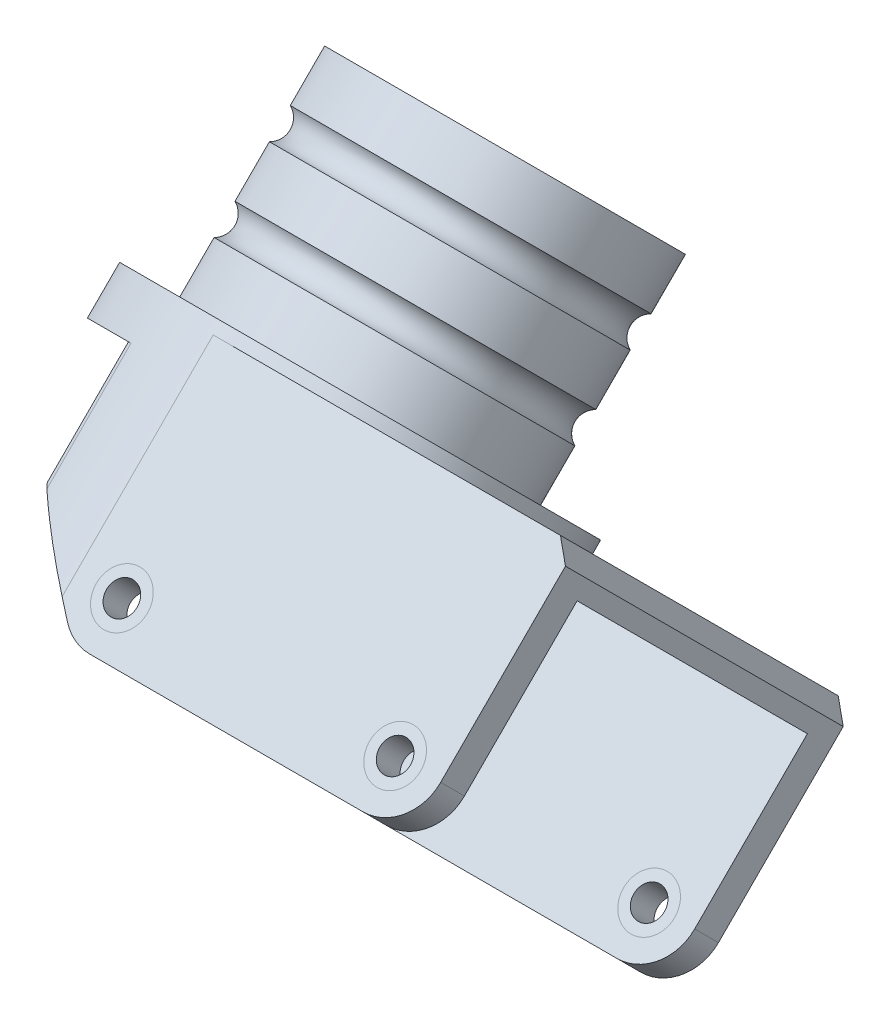
ISO-10303-21;
HEADER;
FILE_DESCRIPTION(('STEP AP214'),'2;1');
FILE_NAME('part.step','',(''),(''),'','','');
FILE_SCHEMA(('AUTOMOTIVE_DESIGN { 1 0 10303 214 1 1 1 1 }'));
ENDSEC;
DATA;
#1=APPLICATION_CONTEXT('core data for automotive mechanical design processes');
#2=APPLICATION_PROTOCOL_DEFINITION('international standard','automotive_design',2000,#1);
#3=PRODUCT_CONTEXT('',#1,'mechanical');
#4=PRODUCT('Part','Part','',(#3));
#5=PRODUCT_RELATED_PRODUCT_CATEGORY('part','',(#4));
#6=PRODUCT_DEFINITION_FORMATION('','',#4);
#7=PRODUCT_DEFINITION_CONTEXT('part definition',#1,'design');
#8=PRODUCT_DEFINITION('design','',#6,#7);
#9=PRODUCT_DEFINITION_SHAPE('','',#8);
#10=(LENGTH_UNIT() NAMED_UNIT(*) SI_UNIT(.MILLI.,.METRE.));
#11=(NAMED_UNIT(*) PLANE_ANGLE_UNIT() SI_UNIT($,.RADIAN.));
#12=(NAMED_UNIT(*) SI_UNIT($,.STERADIAN.) SOLID_ANGLE_UNIT());
#13=UNCERTAINTY_MEASURE_WITH_UNIT(LENGTH_MEASURE(1.E-05),#10,'distance_accuracy_value','');
#14=(GEOMETRIC_REPRESENTATION_CONTEXT(3) GLOBAL_UNCERTAINTY_ASSIGNED_CONTEXT((#13)) GLOBAL_UNIT_ASSIGNED_CONTEXT((#10,
#11,#12)) REPRESENTATION_CONTEXT('',''));
#15=CARTESIAN_POINT('',(0.,0.,0.));
#16=DIRECTION('',(0.,0.,1.));
#17=DIRECTION('',(1.,0.,0.));
#18=AXIS2_PLACEMENT_3D('',#15,#16,#17);
#19=CARTESIAN_POINT('',(4.,41.7193000900052,287.438906552332));
#20=DIRECTION('',(0.,-0.707106781186548,-0.707106781186547));
#21=DIRECTION('',(0.,0.707106781186547,-0.707106781186548));
#22=AXIS2_PLACEMENT_3D('',#19,#20,#21);
#23=PLANE('',#22);
#24=CARTESIAN_POINT('',(4.,41.7193000900051,287.438906552332));
#25=DIRECTION('',(0.,-0.707106781186548,-0.707106781186547));
#26=DIRECTION('',(0.,0.707106781186547,-0.707106781186548));
#27=AXIS2_PLACEMENT_3D('',#24,#25,#26);
#28=CIRCLE('',#27,2.25000000000002);
#29=CARTESIAN_POINT('',(4.,43.3102903476749,285.847916294662));
#30=VERTEX_POINT('',#29);
#31=EDGE_CURVE('E296',#30,#30,#28,.F.);
#32=ORIENTED_EDGE('',*,*,#31,.T.);
#33=EDGE_LOOP('',(#32));
#34=FACE_BOUND('',#33,.T.);
#35=DIRECTION('',(1.,0.,0.));
#36=VECTOR('',#35,1.);
#37=CARTESIAN_POINT('',(32.,53.7401153701766,275.418091272161));
#38=LINE('',#37,#36);
#39=CARTESIAN_POINT('',(0.,53.7401153701765,275.418091272161));
#40=VERTEX_POINT('',#39);
#41=CARTESIAN_POINT('',(30.5,53.7401153701766,275.418091272161));
#42=VERTEX_POINT('',#41);
#43=EDGE_CURVE('E164',#40,#42,#38,.T.);
#44=ORIENTED_EDGE('',*,*,#43,.T.);
#45=DIRECTION('',(-0.707106781186549,0.499999999999999,-0.499999999999999));
#46=VECTOR('',#45,1.);
#47=CARTESIAN_POINT('',(25.75,57.0988725808127,272.059334061525));
#48=LINE('',#47,#46);
#49=CARTESIAN_POINT('',(32.,52.6794551983968,276.47875144394));
#50=VERTEX_POINT('',#49);
#51=EDGE_CURVE('E67',#42,#50,#48,.F.);
#52=ORIENTED_EDGE('',*,*,#51,.T.);
#53=DIRECTION('',(0.,-0.707106781186547,0.707106781186548));
#54=VECTOR('',#53,1.);
#55=CARTESIAN_POINT('',(32.,53.7401153701766,275.418091272161));
#56=LINE('',#55,#54);
#57=CARTESIAN_POINT('',(32.,41.7193000900052,287.438906552332));
#58=VERTEX_POINT('',#57);
#59=EDGE_CURVE('E183',#50,#58,#56,.T.);
#60=ORIENTED_EDGE('',*,*,#59,.T.);
#61=CARTESIAN_POINT('',(28.,41.7193000900052,287.438906552332));
#62=DIRECTION('',(0.,-0.707106781186548,-0.707106781186547));
#63=DIRECTION('',(0.,0.707106781186547,-0.707106781186548));
#64=AXIS2_PLACEMENT_3D('',#61,#62,#63);
#65=CIRCLE('',#64,3.99999999999999);
#66=CARTESIAN_POINT('',(28.,38.890872965259,290.267333677078));
#67=VERTEX_POINT('',#66);
#68=EDGE_CURVE('E390',#58,#67,#65,.T.);
#69=ORIENTED_EDGE('',*,*,#68,.T.);
#70=DIRECTION('',(-1.,0.,0.));
#71=VECTOR('',#70,1.);
#72=CARTESIAN_POINT('',(28.,38.8908729652591,290.267333677078));
#73=LINE('',#72,#71);
#74=CARTESIAN_POINT('',(4.,38.8908729652591,290.267333677078));
#75=VERTEX_POINT('',#74);
#76=EDGE_CURVE('E393',#67,#75,#73,.T.);
#77=ORIENTED_EDGE('',*,*,#76,.T.);
#78=CARTESIAN_POINT('',(4.,41.7193000900052,287.438906552332));
#79=DIRECTION('',(0.,-0.707106781186548,-0.707106781186547));
#80=DIRECTION('',(0.,0.707106781186547,-0.707106781186548));
#81=AXIS2_PLACEMENT_3D('',#78,#79,#80);
#82=CIRCLE('',#81,4.);
#83=CARTESIAN_POINT('',(1.30168005886331,39.6313501989321,289.526856443405));
#84=VERTEX_POINT('',#83);
#85=EDGE_CURVE('E396',#75,#84,#82,.T.);
#86=ORIENTED_EDGE('',*,*,#85,.T.);
#87=DIRECTION('',(-0.738201763377739,0.477000082047162,-0.477000082047161));
#88=VECTOR('',#87,1.);
#89=CARTESIAN_POINT('',(1.30168005886329,39.6313501989321,289.526856443405));
#90=LINE('',#89,#88);
#91=CARTESIAN_POINT('',(0.,40.4724501876885,288.685756454649));
#92=VERTEX_POINT('',#91);
#93=EDGE_CURVE('E167',#84,#92,#90,.T.);
#94=ORIENTED_EDGE('',*,*,#93,.T.);
#95=DIRECTION('',(0.,0.707106781186548,-0.707106781186548));
#96=VECTOR('',#95,1.);
#97=CARTESIAN_POINT('',(0.,26.693280989791,302.464925652546));
#98=LINE('',#97,#96);
#99=EDGE_CURVE('E161',#92,#40,#98,.T.);
#100=ORIENTED_EDGE('',*,*,#99,.T.);
#101=EDGE_LOOP('',(#44,#52,#60,#69,#77,#86,#94,#100));
#102=FACE_BOUND('',#101,.T.);
#103=CARTESIAN_POINT('',(28.,41.7193000900051,287.438906552332));
#104=DIRECTION('',(0.,-0.707106781186548,-0.707106781186547));
#105=DIRECTION('',(0.,0.707106781186547,-0.707106781186548));
#106=AXIS2_PLACEMENT_3D('',#103,#104,#105);
#107=CIRCLE('',#106,2.25000000000001);
#108=CARTESIAN_POINT('',(28.,43.3102903476749,285.847916294662));
#109=VERTEX_POINT('',#108);
#110=EDGE_CURVE('E12',#109,#109,#107,.F.);
#111=ORIENTED_EDGE('',*,*,#110,.T.);
#112=EDGE_LOOP('',(#111));
#113=FACE_BOUND('',#112,.T.);
#114=ADVANCED_FACE('F40',(#34,#102,#113),#23,.T.);
#115=CARTESIAN_POINT('',(0.,186.888322267604,186.888322267604));
#116=DIRECTION('',(0.,0.707106781186547,0.707106781186548));
#117=DIRECTION('',(0.,-0.707106781186548,0.707106781186547));
#118=AXIS2_PLACEMENT_3D('',#115,#116,#117);
#119=PLANE('',#118);
#120=CARTESIAN_POINT('',(4.,64.0285190364406,309.748125498768));
#121=DIRECTION('',(0.,0.707106781186547,0.707106781186548));
#122=DIRECTION('',(0.,-0.707106781186548,0.707106781186547));
#123=AXIS2_PLACEMENT_3D('',#120,#121,#122);
#124=CIRCLE('',#123,2.25000000000002);
#125=CARTESIAN_POINT('',(4.,62.4375287787709,311.339115756437));
#126=VERTEX_POINT('',#125);
#127=EDGE_CURVE('E300',#126,#126,#124,.F.);
#128=ORIENTED_EDGE('',*,*,#127,.F.);
#129=EDGE_LOOP('',(#128));
#130=FACE_BOUND('',#129,.T.);
#131=DIRECTION('',(-0.738201763377739,0.477000082047162,-0.477000082047161));
#132=VECTOR('',#131,1.);
#133=CARTESIAN_POINT('',(1.30168005886329,61.9405691453677,311.836075389841));
#134=LINE('',#133,#132);
#135=CARTESIAN_POINT('',(1.30168005886331,61.9405691453677,311.836075389841));
#136=VERTEX_POINT('',#135);
#137=CARTESIAN_POINT('',(-5.47471460443719,66.3192376486618,307.457406886546));
#138=VERTEX_POINT('',#137);
#139=EDGE_CURVE('E184',#136,#138,#134,.T.);
#140=ORIENTED_EDGE('',*,*,#139,.T.);
#141=DIRECTION('',(0.,-0.707106781186548,0.707106781186547));
#142=VECTOR('',#141,1.);
#143=CARTESIAN_POINT('',(-5.47471460443718,73.9280139730525,299.848630562156));
#144=LINE('',#143,#142);
#145=CARTESIAN_POINT('',(-5.47471460443718,73.9280139730525,299.848630562156));
#146=VERTEX_POINT('',#145);
#147=EDGE_CURVE('E277',#138,#146,#144,.F.);
#148=ORIENTED_EDGE('',*,*,#147,.T.);
#149=DIRECTION('',(1.,0.,0.));
#150=VECTOR('',#149,1.);
#151=CARTESIAN_POINT('',(-17.2499999999995,73.9280139730525,299.848630562156));
#152=LINE('',#151,#150);
#153=CARTESIAN_POINT('',(32.,73.9280139730525,299.848630562156));
#154=VERTEX_POINT('',#153);
#155=EDGE_CURVE('E224',#146,#154,#152,.T.);
#156=ORIENTED_EDGE('',*,*,#155,.T.);
#157=DIRECTION('',(0.,-0.707106781186548,0.707106781186547));
#158=VECTOR('',#157,1.);
#159=CARTESIAN_POINT('',(32.,76.0493343166122,297.727310218596));
#160=LINE('',#159,#158);
#161=CARTESIAN_POINT('',(32.,64.0285190364408,309.748125498767));
#162=VERTEX_POINT('',#161);
#163=EDGE_CURVE('E221',#154,#162,#160,.T.);
#164=ORIENTED_EDGE('',*,*,#163,.T.);
#165=CARTESIAN_POINT('',(28.,64.0285190364408,309.748125498767));
#166=DIRECTION('',(0.,0.707106781186547,0.707106781186548));
#167=DIRECTION('',(0.,-0.707106781186548,0.707106781186547));
#168=AXIS2_PLACEMENT_3D('',#165,#166,#167);
#169=CIRCLE('',#168,3.99999999999999);
#170=CARTESIAN_POINT('',(28.,61.2000919116946,312.576552623514));
#171=VERTEX_POINT('',#170);
#172=EDGE_CURVE('E240',#162,#171,#169,.F.);
#173=ORIENTED_EDGE('',*,*,#172,.T.);
#174=DIRECTION('',(-1.,0.,0.));
#175=VECTOR('',#174,1.);
#176=CARTESIAN_POINT('',(28.,61.2000919116946,312.576552623514));
#177=LINE('',#176,#175);
#178=CARTESIAN_POINT('',(4.,61.2000919116946,312.576552623514));
#179=VERTEX_POINT('',#178);
#180=EDGE_CURVE('E260',#171,#179,#177,.T.);
#181=ORIENTED_EDGE('',*,*,#180,.T.);
#182=CARTESIAN_POINT('',(4.,64.0285190364408,309.748125498767));
#183=DIRECTION('',(0.,0.707106781186547,0.707106781186548));
#184=DIRECTION('',(0.,-0.707106781186548,0.707106781186547));
#185=AXIS2_PLACEMENT_3D('',#182,#183,#184);
#186=CIRCLE('',#185,4.);
#187=EDGE_CURVE('E258',#179,#136,#186,.F.);
#188=ORIENTED_EDGE('',*,*,#187,.T.);
#189=EDGE_LOOP('',(#140,#148,#156,#164,#173,#181,#188));
#190=FACE_BOUND('',#189,.T.);
#191=CARTESIAN_POINT('',(28.,64.0285190364406,309.748125498768));
#192=DIRECTION('',(0.,0.707106781186547,0.707106781186548));
#193=DIRECTION('',(0.,-0.707106781186548,0.707106781186547));
#194=AXIS2_PLACEMENT_3D('',#191,#192,#193);
#195=CIRCLE('',#194,2.25000000000001);
#196=CARTESIAN_POINT('',(28.,62.4375287787709,311.339115756437));
#197=VERTEX_POINT('',#196);
#198=EDGE_CURVE('E51',#197,#197,#195,.F.);
#199=ORIENTED_EDGE('',*,*,#198,.F.);
#200=EDGE_LOOP('',(#199));
#201=FACE_BOUND('',#200,.T.);
#202=ADVANCED_FACE('F344',(#130,#190,#201),#119,.F.);
#203=CARTESIAN_POINT('',(0.,166.665068325669,166.665068325669));
#204=DIRECTION('',(0.,0.707106781186547,0.707106781186548));
#205=DIRECTION('',(0.,-0.707106781186548,0.707106781186547));
#206=AXIS2_PLACEMENT_3D('',#203,#204,#205);
#207=PLANE('',#206);
#208=CARTESIAN_POINT('',(4.,43.8052650945054,289.524871556832));
#209=DIRECTION('',(0.,0.707106781186547,0.707106781186548));
#210=DIRECTION('',(0.,-0.707106781186548,0.707106781186547));
#211=AXIS2_PLACEMENT_3D('',#208,#209,#210);
#212=CIRCLE('',#211,2.25000000000002);
#213=CARTESIAN_POINT('',(4.,42.2142748368356,291.115861814502));
#214=VERTEX_POINT('',#213);
#215=EDGE_CURVE('E304',#214,#214,#212,.F.);
#216=ORIENTED_EDGE('',*,*,#215,.T.);
#217=EDGE_LOOP('',(#216));
#218=FACE_BOUND('',#217,.T.);
#219=DIRECTION('',(1.,0.,0.));
#220=VECTOR('',#219,1.);
#221=CARTESIAN_POINT('',(-17.2499999999995,53.7047600311172,279.625376620221));
#222=LINE('',#221,#220);
#223=CARTESIAN_POINT('',(-5.47471460442752,53.7047600311172,279.625376620221));
#224=VERTEX_POINT('',#223);
#225=CARTESIAN_POINT('',(32.,53.7047600311172,279.625376620221));
#226=VERTEX_POINT('',#225);
#227=EDGE_CURVE('E222',#224,#226,#222,.T.);
#228=ORIENTED_EDGE('',*,*,#227,.F.);
#229=DIRECTION('',(0.,0.707106781186548,-0.707106781186547));
#230=VECTOR('',#229,1.);
#231=CARTESIAN_POINT('',(-5.47471460442752,166.665068325669,166.665068325669));
#232=LINE('',#231,#230);
#233=CARTESIAN_POINT('',(-5.47471460442751,46.0959837067203,287.234152944617));
#234=VERTEX_POINT('',#233);
#235=EDGE_CURVE('E271',#224,#234,#232,.F.);
#236=ORIENTED_EDGE('',*,*,#235,.T.);
#237=DIRECTION('',(-0.738201763377739,0.477000082047162,-0.477000082047161));
#238=VECTOR('',#237,1.);
#239=CARTESIAN_POINT('',(1.30168005886328,41.7173152034324,291.612821447905));
#240=LINE('',#239,#238);
#241=CARTESIAN_POINT('',(1.30168005886331,41.7173152034324,291.612821447905));
#242=VERTEX_POINT('',#241);
#243=EDGE_CURVE('E237',#242,#234,#240,.T.);
#244=ORIENTED_EDGE('',*,*,#243,.F.);
#245=CARTESIAN_POINT('',(4.,43.8052650945055,289.524871556832));
#246=DIRECTION('',(0.,0.707106781186547,0.707106781186548));
#247=DIRECTION('',(0.,-0.707106781186548,0.707106781186547));
#248=AXIS2_PLACEMENT_3D('',#245,#246,#247);
#249=CIRCLE('',#248,4.);
#250=CARTESIAN_POINT('',(4.,40.9768379697593,292.353298681578));
#251=VERTEX_POINT('',#250);
#252=EDGE_CURVE('E234',#251,#242,#249,.F.);
#253=ORIENTED_EDGE('',*,*,#252,.F.);
#254=DIRECTION('',(-1.,0.,0.));
#255=VECTOR('',#254,1.);
#256=CARTESIAN_POINT('',(28.,40.9768379697593,292.353298681578));
#257=LINE('',#256,#255);
#258=CARTESIAN_POINT('',(28.,40.9768379697593,292.353298681578));
#259=VERTEX_POINT('',#258);
#260=EDGE_CURVE('E231',#259,#251,#257,.T.);
#261=ORIENTED_EDGE('',*,*,#260,.F.);
#262=CARTESIAN_POINT('',(28.,43.8052650945055,289.524871556832));
#263=DIRECTION('',(0.,0.707106781186547,0.707106781186548));
#264=DIRECTION('',(0.,-0.707106781186548,0.707106781186547));
#265=AXIS2_PLACEMENT_3D('',#262,#263,#264);
#266=CIRCLE('',#265,3.99999999999999);
#267=CARTESIAN_POINT('',(32.,43.8052650945055,289.524871556832));
#268=VERTEX_POINT('',#267);
#269=EDGE_CURVE('E228',#268,#259,#266,.F.);
#270=ORIENTED_EDGE('',*,*,#269,.F.);
#271=DIRECTION('',(0.,-0.707106781186548,0.707106781186547));
#272=VECTOR('',#271,1.);
#273=CARTESIAN_POINT('',(32.,55.8260803746769,277.504056276661));
#274=LINE('',#273,#272);
#275=EDGE_CURVE('E217',#226,#268,#274,.T.);
#276=ORIENTED_EDGE('',*,*,#275,.F.);
#277=EDGE_LOOP('',(#228,#236,#244,#253,#261,#270,#276));
#278=FACE_BOUND('',#277,.T.);
#279=CARTESIAN_POINT('',(28.,43.8052650945054,289.524871556832));
#280=DIRECTION('',(0.,0.707106781186547,0.707106781186548));
#281=DIRECTION('',(0.,-0.707106781186548,0.707106781186547));
#282=AXIS2_PLACEMENT_3D('',#279,#280,#281);
#283=CIRCLE('',#282,2.25000000000001);
#284=CARTESIAN_POINT('',(28.,42.2142748368356,291.115861814502));
#285=VERTEX_POINT('',#284);
#286=EDGE_CURVE('E313',#285,#285,#283,.F.);
#287=ORIENTED_EDGE('',*,*,#286,.T.);
#288=EDGE_LOOP('',(#287));
#289=FACE_BOUND('',#288,.T.);
#290=ADVANCED_FACE('F332',(#218,#278,#289),#207,.T.);
#291=CARTESIAN_POINT('',(4.,66.1144840409411,311.834090503268));
#292=DIRECTION('',(0.,-0.707106781186548,-0.707106781186547));
#293=DIRECTION('',(0.,0.707106781186547,-0.707106781186548));
#294=AXIS2_PLACEMENT_3D('',#291,#292,#293);
#295=PLANE('',#294);
#296=CARTESIAN_POINT('',(4.,66.114484040941,311.834090503268));
#297=DIRECTION('',(0.,-0.707106781186548,-0.707106781186547));
#298=DIRECTION('',(0.,0.707106781186547,-0.707106781186548));
#299=AXIS2_PLACEMENT_3D('',#296,#297,#298);
#300=CIRCLE('',#299,2.25000000000002);
#301=CARTESIAN_POINT('',(4.,67.7054742986107,310.243100245598));
#302=VERTEX_POINT('',#301);
#303=EDGE_CURVE('E295',#302,#302,#300,.F.);
#304=ORIENTED_EDGE('',*,*,#303,.F.);
#305=EDGE_LOOP('',(#304));
#306=FACE_BOUND('',#305,.T.);
#307=DIRECTION('',(0.,-0.707106781186547,0.707106781186548));
#308=VECTOR('',#307,1.);
#309=CARTESIAN_POINT('',(32.,78.1352993211125,299.813275223096));
#310=LINE('',#309,#308);
#311=CARTESIAN_POINT('',(32.,77.0746391493327,300.873935394876));
#312=VERTEX_POINT('',#311);
#313=CARTESIAN_POINT('',(32.,66.1144840409411,311.834090503268));
#314=VERTEX_POINT('',#313);
#315=EDGE_CURVE('E401',#312,#314,#310,.T.);
#316=ORIENTED_EDGE('',*,*,#315,.F.);
#317=DIRECTION('',(0.707106781186549,-0.499999999999999,0.499999999999999));
#318=VECTOR('',#317,1.);
#319=CARTESIAN_POINT('',(30.5,78.1352993211125,299.813275223096));
#320=LINE('',#319,#318);
#321=CARTESIAN_POINT('',(30.5,78.1352993211125,299.813275223096));
#322=VERTEX_POINT('',#321);
#323=EDGE_CURVE('E293',#312,#322,#320,.F.);
#324=ORIENTED_EDGE('',*,*,#323,.T.);
#325=DIRECTION('',(1.,0.,0.));
#326=VECTOR('',#325,1.);
#327=CARTESIAN_POINT('',(32.,78.1352993211125,299.813275223096));
#328=LINE('',#327,#326);
#329=CARTESIAN_POINT('',(0.,78.1352993211124,299.813275223097));
#330=VERTEX_POINT('',#329);
#331=EDGE_CURVE('E399',#330,#322,#328,.T.);
#332=ORIENTED_EDGE('',*,*,#331,.F.);
#333=DIRECTION('',(0.,0.707106781186548,-0.707106781186548));
#334=VECTOR('',#333,1.);
#335=CARTESIAN_POINT('',(0.,51.088464940727,326.860109603482));
#336=LINE('',#335,#334);
#337=CARTESIAN_POINT('',(0.,64.8676341386244,313.080940405585));
#338=VERTEX_POINT('',#337);
#339=EDGE_CURVE('E188',#338,#330,#336,.T.);
#340=ORIENTED_EDGE('',*,*,#339,.F.);
#341=DIRECTION('',(-0.738201763377739,0.477000082047162,-0.477000082047161));
#342=VECTOR('',#341,1.);
#343=CARTESIAN_POINT('',(1.30168005886329,64.026534149868,313.922040394341));
#344=LINE('',#343,#342);
#345=CARTESIAN_POINT('',(1.30168005886331,64.026534149868,313.922040394341));
#346=VERTEX_POINT('',#345);
#347=EDGE_CURVE('E412',#346,#338,#344,.T.);
#348=ORIENTED_EDGE('',*,*,#347,.F.);
#349=CARTESIAN_POINT('',(4.,66.1144840409411,311.834090503268));
#350=DIRECTION('',(0.,-0.707106781186548,-0.707106781186547));
#351=DIRECTION('',(0.,0.707106781186547,-0.707106781186548));
#352=AXIS2_PLACEMENT_3D('',#349,#350,#351);
#353=CIRCLE('',#352,4.);
#354=CARTESIAN_POINT('',(4.,63.2860569161949,314.662517628014));
#355=VERTEX_POINT('',#354);
#356=EDGE_CURVE('E409',#355,#346,#353,.T.);
#357=ORIENTED_EDGE('',*,*,#356,.F.);
#358=DIRECTION('',(-1.,0.,0.));
#359=VECTOR('',#358,1.);
#360=CARTESIAN_POINT('',(28.,63.2860569161949,314.662517628014));
#361=LINE('',#360,#359);
#362=CARTESIAN_POINT('',(28.,63.2860569161949,314.662517628014));
#363=VERTEX_POINT('',#362);
#364=EDGE_CURVE('E406',#363,#355,#361,.T.);
#365=ORIENTED_EDGE('',*,*,#364,.F.);
#366=CARTESIAN_POINT('',(28.,66.1144840409411,311.834090503268));
#367=DIRECTION('',(0.,-0.707106781186548,-0.707106781186547));
#368=DIRECTION('',(0.,0.707106781186547,-0.707106781186548));
#369=AXIS2_PLACEMENT_3D('',#366,#367,#368);
#370=CIRCLE('',#369,3.99999999999999);
#371=EDGE_CURVE('E403',#314,#363,#370,.T.);
#372=ORIENTED_EDGE('',*,*,#371,.F.);
#373=EDGE_LOOP('',(#316,#324,#332,#340,#348,#357,#365,#372));
#374=FACE_BOUND('',#373,.T.);
#375=CARTESIAN_POINT('',(28.,66.114484040941,311.834090503268));
#376=DIRECTION('',(0.,-0.707106781186548,-0.707106781186547));
#377=DIRECTION('',(0.,0.707106781186547,-0.707106781186548));
#378=AXIS2_PLACEMENT_3D('',#375,#376,#377);
#379=CIRCLE('',#378,2.25000000000001);
#380=CARTESIAN_POINT('',(28.,67.7054742986107,310.243100245598));
#381=VERTEX_POINT('',#380);
#382=EDGE_CURVE('E45',#381,#381,#379,.F.);
#383=ORIENTED_EDGE('',*,*,#382,.F.);
#384=EDGE_LOOP('',(#383));
#385=FACE_BOUND('',#384,.T.);
#386=ADVANCED_FACE('F329',(#306,#374,#385),#295,.F.);
#387=ORIENTED_EDGE('',*,*,#110,.F.);
#388=EDGE_LOOP('',(#387));
#389=FACE_BOUND('',#388,.T.);
#390=CARTESIAN_POINT('',(28.,41.7193000900052,287.438906552332));
#391=DIRECTION('',(0.,-0.707106781186548,-0.707106781186547));
#392=DIRECTION('',(0.,0.707106781186547,-0.707106781186548));
#393=AXIS2_PLACEMENT_3D('',#390,#391,#392);
#394=CIRCLE('',#393,1.34999999999999);
#395=CARTESIAN_POINT('',(28.,42.673894244607,286.48431239773));
#396=VERTEX_POINT('',#395);
#397=EDGE_CURVE('E225',#396,#396,#394,.T.);
#398=ORIENTED_EDGE('',*,*,#397,.F.);
#399=EDGE_LOOP('',(#398));
#400=FACE_BOUND('',#399,.T.);
#401=ADVANCED_FACE('F331',(#389,#400),#23,.T.);
#402=ORIENTED_EDGE('',*,*,#198,.T.);
#403=EDGE_LOOP('',(#402));
#404=FACE_BOUND('',#403,.T.);
#405=CARTESIAN_POINT('',(28.,64.0285190364407,309.748125498768));
#406=DIRECTION('',(0.,0.707106781186547,0.707106781186548));
#407=DIRECTION('',(0.,-0.707106781186548,0.707106781186547));
#408=AXIS2_PLACEMENT_3D('',#405,#406,#407);
#409=CIRCLE('',#408,1.34999999999999);
#410=CARTESIAN_POINT('',(28.,63.0739248818389,310.702719653369));
#411=VERTEX_POINT('',#410);
#412=EDGE_CURVE('E249',#411,#411,#409,.T.);
#413=ORIENTED_EDGE('',*,*,#412,.T.);
#414=EDGE_LOOP('',(#413));
#415=FACE_BOUND('',#414,.T.);
#416=ADVANCED_FACE('F340',(#404,#415),#119,.F.);
#417=ORIENTED_EDGE('',*,*,#286,.F.);
#418=EDGE_LOOP('',(#417));
#419=FACE_BOUND('',#418,.T.);
#420=CARTESIAN_POINT('',(28.,43.8052650945054,289.524871556832));
#421=DIRECTION('',(0.,0.707106781186547,0.707106781186548));
#422=DIRECTION('',(0.,-0.707106781186548,0.707106781186547));
#423=AXIS2_PLACEMENT_3D('',#420,#421,#422);
#424=CIRCLE('',#423,1.34999999999999);
#425=CARTESIAN_POINT('',(28.,42.8506709399036,290.479465711434));
#426=VERTEX_POINT('',#425);
#427=EDGE_CURVE('E246',#426,#426,#424,.T.);
#428=ORIENTED_EDGE('',*,*,#427,.F.);
#429=EDGE_LOOP('',(#428));
#430=FACE_BOUND('',#429,.T.);
#431=ADVANCED_FACE('F347',(#419,#430),#207,.T.);
#432=ORIENTED_EDGE('',*,*,#382,.T.);
#433=EDGE_LOOP('',(#432));
#434=FACE_BOUND('',#433,.T.);
#435=CARTESIAN_POINT('',(28.,66.1144840409411,311.834090503268));
#436=DIRECTION('',(0.,0.707106781186548,0.707106781186548));
#437=DIRECTION('',(0.,-0.707106781186548,0.707106781186548));
#438=AXIS2_PLACEMENT_3D('',#435,#436,#437);
#439=CIRCLE('',#438,1.35);
#440=CARTESIAN_POINT('',(28.,65.1598898863393,312.78868465787));
#441=VERTEX_POINT('',#440);
#442=EDGE_CURVE('E250',#441,#441,#439,.T.);
#443=ORIENTED_EDGE('',*,*,#442,.F.);
#444=EDGE_LOOP('',(#443));
#445=FACE_BOUND('',#444,.T.);
#446=ADVANCED_FACE('F326',(#434,#445),#295,.F.);
#447=ORIENTED_EDGE('',*,*,#303,.T.);
#448=EDGE_LOOP('',(#447));
#449=FACE_BOUND('',#448,.T.);
#450=CARTESIAN_POINT('',(4.,66.1144840409411,311.834090503268));
#451=DIRECTION('',(0.,0.707106781186548,0.707106781186548));
#452=DIRECTION('',(0.,-0.707106781186548,0.707106781186548));
#453=AXIS2_PLACEMENT_3D('',#450,#451,#452);
#454=CIRCLE('',#453,1.35);
#455=CARTESIAN_POINT('',(4.,65.1598898863393,312.78868465787));
#456=VERTEX_POINT('',#455);
#457=EDGE_CURVE('E245',#456,#456,#454,.T.);
#458=ORIENTED_EDGE('',*,*,#457,.F.);
#459=EDGE_LOOP('',(#458));
#460=FACE_BOUND('',#459,.T.);
#461=ADVANCED_FACE('F335',(#449,#460),#295,.F.);
#462=CARTESIAN_POINT('',(1.30168005886329,64.026534149868,313.922040394341));
#463=DIRECTION('',(-0.674579985284175,-0.521987472768266,0.521987472768266));
#464=DIRECTION('',(0.61197672109764,0.,0.790875775855211));
#465=AXIS2_PLACEMENT_3D('',#462,#463,#464);
#466=PLANE('',#465);
#467=CARTESIAN_POINT('',(0.,52.6700421631574,300.883348430118));
#468=DIRECTION('',(-0.674579985284175,-0.521987472768266,0.521987472768266));
#469=DIRECTION('',(-0.738201763377739,0.477000082047161,-0.477000082047161));
#470=AXIS2_PLACEMENT_3D('',#467,#468,#469);
#471=ELLIPSE('',#470,23.3675952236547,17.2499999999991);
#472=CARTESIAN_POINT('',(-5.81162011855623,67.9098091847211,308.612585374663));
#473=VERTEX_POINT('',#472);
#474=EDGE_CURVE('E454',#338,#473,#471,.T.);
#475=ORIENTED_EDGE('',*,*,#474,.T.);
#476=CARTESIAN_POINT('',(-5.47471460443718,67.0263444298482,308.164513667733));
#477=DIRECTION('',(-0.674579985284175,-0.521987472768266,0.521987472768266));
#478=DIRECTION('',(-0.738201763377739,0.477000082047156,-0.477000082047167));
#479=AXIS2_PLACEMENT_3D('',#476,#477,#478);
#480=ELLIPSE('',#479,1.35464320137136,1.);
#481=EDGE_CURVE('E275',#473,#138,#480,.T.);
#482=ORIENTED_EDGE('',*,*,#481,.T.);
#483=ORIENTED_EDGE('',*,*,#139,.F.);
#484=DIRECTION('',(0.,-0.707106781186548,-0.707106781186547));
#485=VECTOR('',#484,1.);
#486=CARTESIAN_POINT('',(1.30168005886331,64.026534149868,313.922040394341));
#487=LINE('',#486,#485);
#488=EDGE_CURVE('E196',#346,#136,#487,.T.);
#489=ORIENTED_EDGE('',*,*,#488,.F.);
#490=ORIENTED_EDGE('',*,*,#347,.T.);
#491=EDGE_LOOP('',(#475,#482,#483,#489,#490));
#492=FACE_BOUND('',#491,.T.);
#493=ADVANCED_FACE('F354',(#492),#466,.T.);
#494=CARTESIAN_POINT('',(-17.2499999999995,73.8926586339932,299.813275223096));
#495=DIRECTION('',(0.,0.707106781186547,-0.707106781186548));
#496=DIRECTION('',(0.,0.707106781186548,0.707106781186547));
#497=AXIS2_PLACEMENT_3D('',#494,#495,#496);
#498=PLANE('',#497);
#499=CARTESIAN_POINT('',(0.,63.8163870020859,289.737003591189));
#500=DIRECTION('',(0.,0.707106781186547,-0.707106781186548));
#501=DIRECTION('',(0.,0.707106781186548,0.707106781186547));
#502=AXIS2_PLACEMENT_3D('',#499,#500,#501);
#503=CIRCLE('',#502,11.4499999999995);
#504=CARTESIAN_POINT('',(0.,71.9127596466715,297.833376235775));
#505=VERTEX_POINT('',#504);
#506=EDGE_CURVE('E284',#505,#505,#503,.T.);
#507=ORIENTED_EDGE('',*,*,#506,.T.);
#508=EDGE_LOOP('',(#507));
#509=FACE_BOUND('',#508,.T.);
#510=CARTESIAN_POINT('',(0.,63.8163870020859,289.737003591189));
#511=DIRECTION('',(0.,0.707106781186547,-0.707106781186548));
#512=DIRECTION('',(0.,0.707106781186548,0.707106781186547));
#513=AXIS2_PLACEMENT_3D('',#510,#511,#512);
#514=CIRCLE('',#513,17.2499999999991);
#515=CARTESIAN_POINT('',(-5.81162011854598,52.3318850190289,278.252501608132));
#516=VERTEX_POINT('',#515);
#517=CARTESIAN_POINT('',(-5.81162011855626,75.3008889851403,301.221505574244));
#518=VERTEX_POINT('',#517);
#519=EDGE_CURVE('E451',#516,#518,#514,.T.);
#520=ORIENTED_EDGE('',*,*,#519,.F.);
#521=CARTESIAN_POINT('',(-5.47471460442752,52.9976532499305,278.918269839034));
#522=DIRECTION('',(0.,0.707106781186547,-0.707106781186548));
#523=DIRECTION('',(0.,0.707106781186548,0.707106781186547));
#524=AXIS2_PLACEMENT_3D('',#521,#522,#523);
#525=CIRCLE('',#524,1.);
#526=EDGE_CURVE('E279',#516,#224,#525,.T.);
#527=ORIENTED_EDGE('',*,*,#526,.T.);
#528=ORIENTED_EDGE('',*,*,#227,.T.);
#529=DIRECTION('',(0.,0.707106781186548,0.707106781186547));
#530=VECTOR('',#529,1.);
#531=CARTESIAN_POINT('',(32.,76.0139789775528,301.934595566656));
#532=LINE('',#531,#530);
#533=EDGE_CURVE('E218',#226,#154,#532,.T.);
#534=ORIENTED_EDGE('',*,*,#533,.T.);
#535=ORIENTED_EDGE('',*,*,#155,.F.);
#536=CARTESIAN_POINT('',(-5.47471460443718,74.6351207542388,300.555737343342));
#537=DIRECTION('',(0.,0.707106781186547,-0.707106781186548));
#538=DIRECTION('',(0.,0.707106781186548,0.707106781186547));
#539=AXIS2_PLACEMENT_3D('',#536,#537,#538);
#540=CIRCLE('',#539,1.);
#541=EDGE_CURVE('E281',#146,#518,#540,.T.);
#542=ORIENTED_EDGE('',*,*,#541,.T.);
#543=EDGE_LOOP('',(#520,#527,#528,#534,#535,#542));
#544=FACE_BOUND('',#543,.T.);
#545=ADVANCED_FACE('F470',(#509,#544),#498,.F.);
#546=ORIENTED_EDGE('',*,*,#127,.T.);
#547=EDGE_LOOP('',(#546));
#548=FACE_BOUND('',#547,.T.);
#549=CARTESIAN_POINT('',(4.,64.0285190364407,309.748125498768));
#550=DIRECTION('',(0.,0.707106781186547,0.707106781186548));
#551=DIRECTION('',(0.,-0.707106781186548,0.707106781186547));
#552=AXIS2_PLACEMENT_3D('',#549,#550,#551);
#553=CIRCLE('',#552,1.34999999999999);
#554=CARTESIAN_POINT('',(4.,63.0739248818389,310.702719653369));
#555=VERTEX_POINT('',#554);
#556=EDGE_CURVE('E244',#555,#555,#553,.T.);
#557=ORIENTED_EDGE('',*,*,#556,.T.);
#558=EDGE_LOOP('',(#557));
#559=FACE_BOUND('',#558,.T.);
#560=ADVANCED_FACE('F363',(#548,#559),#119,.F.);
#561=ORIENTED_EDGE('',*,*,#243,.T.);
#562=CARTESIAN_POINT('',(-5.47471460442752,45.3888769255336,286.527046163431));
#563=DIRECTION('',(-0.674579985284175,-0.521987472768266,0.521987472768266));
#564=DIRECTION('',(-0.738201763377739,0.477000082047156,-0.477000082047167));
#565=AXIS2_PLACEMENT_3D('',#562,#563,#564);
#566=ELLIPSE('',#565,1.35464320137136,1.);
#567=CARTESIAN_POINT('',(-5.81162011854617,44.9408052186028,285.643581408558));
#568=VERTEX_POINT('',#567);
#569=EDGE_CURVE('E273',#234,#568,#566,.T.);
#570=ORIENTED_EDGE('',*,*,#569,.T.);
#571=CARTESIAN_POINT('',(0.,52.6700421631574,300.883348430118));
#572=DIRECTION('',(-0.674579985284175,-0.521987472768266,0.521987472768266));
#573=DIRECTION('',(-0.738201763377739,0.477000082047161,-0.477000082047161));
#574=AXIS2_PLACEMENT_3D('',#571,#572,#573);
#575=ELLIPSE('',#574,23.3675952236553,17.2499999999995);
#576=EDGE_CURVE('E172',#92,#568,#575,.F.);
#577=ORIENTED_EDGE('',*,*,#576,.F.);
#578=ORIENTED_EDGE('',*,*,#93,.F.);
#579=EDGE_CURVE('E418',#242,#84,#487,.T.);
#580=ORIENTED_EDGE('',*,*,#579,.F.);
#581=EDGE_LOOP('',(#561,#570,#577,#578,#580));
#582=FACE_BOUND('',#581,.T.);
#583=ADVANCED_FACE('F447',(#582),#466,.T.);
#584=CARTESIAN_POINT('',(4.,66.1144840409411,311.834090503268));
#585=DIRECTION('',(0.,-0.707106781186548,-0.707106781186547));
#586=DIRECTION('',(0.,0.707106781186547,-0.707106781186548));
#587=AXIS2_PLACEMENT_3D('',#584,#585,#586);
#588=CYLINDRICAL_SURFACE('',#587,4.);
#589=DIRECTION('',(0.,-0.707106781186548,-0.707106781186547));
#590=VECTOR('',#589,1.);
#591=CARTESIAN_POINT('',(4.,63.2860569161949,314.662517628014));
#592=LINE('',#591,#590);
#593=EDGE_CURVE('E422',#251,#75,#592,.T.);
#594=ORIENTED_EDGE('',*,*,#593,.F.);
#595=ORIENTED_EDGE('',*,*,#252,.T.);
#596=ORIENTED_EDGE('',*,*,#579,.T.);
#597=ORIENTED_EDGE('',*,*,#85,.F.);
#598=EDGE_LOOP('',(#594,#595,#596,#597));
#599=FACE_BOUND('',#598,.T.);
#600=ADVANCED_FACE('F444',(#599),#588,.T.);
#601=CARTESIAN_POINT('',(28.,63.2860569161949,314.662517628014));
#602=DIRECTION('',(0.,-0.707106781186547,0.707106781186548));
#603=DIRECTION('',(0.,-0.707106781186548,-0.707106781186547));
#604=AXIS2_PLACEMENT_3D('',#601,#602,#603);
#605=PLANE('',#604);
#606=DIRECTION('',(0.,-0.707106781186548,-0.707106781186547));
#607=VECTOR('',#606,1.);
#608=CARTESIAN_POINT('',(28.,63.2860569161949,314.662517628014));
#609=LINE('',#608,#607);
#610=EDGE_CURVE('E425',#259,#67,#609,.T.);
#611=ORIENTED_EDGE('',*,*,#610,.F.);
#612=ORIENTED_EDGE('',*,*,#260,.T.);
#613=ORIENTED_EDGE('',*,*,#593,.T.);
#614=ORIENTED_EDGE('',*,*,#76,.F.);
#615=EDGE_LOOP('',(#611,#612,#613,#614));
#616=FACE_BOUND('',#615,.T.);
#617=ADVANCED_FACE('F441',(#616),#605,.T.);
#618=CARTESIAN_POINT('',(28.,66.1144840409411,311.834090503268));
#619=DIRECTION('',(0.,-0.707106781186548,-0.707106781186547));
#620=DIRECTION('',(0.,0.707106781186547,-0.707106781186548));
#621=AXIS2_PLACEMENT_3D('',#618,#619,#620);
#622=CYLINDRICAL_SURFACE('',#621,3.99999999999999);
#623=DIRECTION('',(0.,-0.707106781186548,-0.707106781186547));
#624=VECTOR('',#623,1.);
#625=CARTESIAN_POINT('',(32.,66.1144840409411,311.834090503268));
#626=LINE('',#625,#624);
#627=EDGE_CURVE('E415',#268,#58,#626,.T.);
#628=ORIENTED_EDGE('',*,*,#627,.F.);
#629=ORIENTED_EDGE('',*,*,#269,.T.);
#630=ORIENTED_EDGE('',*,*,#610,.T.);
#631=ORIENTED_EDGE('',*,*,#68,.F.);
#632=EDGE_LOOP('',(#628,#629,#630,#631));
#633=FACE_BOUND('',#632,.T.);
#634=ADVANCED_FACE('F436',(#633),#622,.T.);
#635=CARTESIAN_POINT('',(0.,70.2157033718243,265.023621588719));
#636=DIRECTION('',(0.,0.707106781186544,-0.707106781186551));
#637=DIRECTION('',(0.,0.707106781186551,0.707106781186544));
#638=AXIS2_PLACEMENT_3D('',#635,#636,#637);
#639=PLANE('',#638);
#640=CARTESIAN_POINT('',(0.,79.3727361881899,274.180654405085));
#641=DIRECTION('',(0.,-0.707106781186544,0.707106781186551));
#642=DIRECTION('',(0.,-0.707106781186551,-0.707106781186544));
#643=AXIS2_PLACEMENT_3D('',#640,#641,#642);
#644=CIRCLE('',#643,10.9499999999997);
#645=CARTESIAN_POINT('',(0.,71.6299169341974,266.437835151093));
#646=VERTEX_POINT('',#645);
#647=EDGE_CURVE('E214',#646,#646,#644,.T.);
#648=ORIENTED_EDGE('',*,*,#647,.T.);
#649=EDGE_LOOP('',(#648));
#650=FACE_BOUND('',#649,.T.);
#651=CARTESIAN_POINT('',(0.,79.3727361881899,274.180654405085));
#652=DIRECTION('',(0.,-0.707106781186544,0.707106781186551));
#653=DIRECTION('',(0.,-0.707106781186551,-0.707106781186544));
#654=AXIS2_PLACEMENT_3D('',#651,#652,#653);
#655=CIRCLE('',#654,12.9499999999997);
#656=CARTESIAN_POINT('',(0.,70.2157033718243,265.023621588719));
#657=VERTEX_POINT('',#656);
#658=EDGE_CURVE('E189',#657,#657,#655,.T.);
#659=ORIENTED_EDGE('',*,*,#658,.F.);
#660=EDGE_LOOP('',(#659));
#661=FACE_BOUND('',#660,.T.);
#662=ADVANCED_FACE('F638',(#650,#661),#639,.T.);
#663=CARTESIAN_POINT('',(0.,38.5932991447525,314.960091448523));
#664=DIRECTION('',(0.,-0.707106781186544,0.707106781186551));
#665=DIRECTION('',(0.,-0.707106781186551,-0.707106781186544));
#666=AXIS2_PLACEMENT_3D('',#663,#664,#665);
#667=CYLINDRICAL_SURFACE('',#666,10.9499999999997);
#668=CARTESIAN_POINT('',(0.,64.1699403926792,289.383450200596));
#669=DIRECTION('',(0.,0.707106781186561,-0.707106781186534));
#670=DIRECTION('',(0.,0.707106781186534,0.707106781186561));
#671=AXIS2_PLACEMENT_3D('',#668,#669,#670);
#672=CIRCLE('',#671,10.9499999999997);
#673=CARTESIAN_POINT('',(0.,71.9127596466715,297.126269454589));
#674=VERTEX_POINT('',#673);
#675=EDGE_CURVE('E287',#674,#674,#672,.F.);
#676=ORIENTED_EDGE('',*,*,#675,.T.);
#677=EDGE_LOOP('',(#676));
#678=FACE_BOUND('',#677,.T.);
#679=ORIENTED_EDGE('',*,*,#647,.F.);
#680=EDGE_LOOP('',(#679));
#681=FACE_BOUND('',#680,.T.);
#682=ADVANCED_FACE('F633',(#678,#681),#667,.F.);
#683=CARTESIAN_POINT('',(0.,56.038212409034,276.301974748645));
#684=DIRECTION('',(0.,0.707106781186544,-0.707106781186551));
#685=DIRECTION('',(0.,0.707106781186551,0.707106781186544));
#686=AXIS2_PLACEMENT_3D('',#683,#684,#685);
#687=PLANE('',#686);
#688=CARTESIAN_POINT('',(0.,66.6448141268321,286.908576466443));
#689=DIRECTION('',(0.,-0.707106781186544,0.707106781186551));
#690=DIRECTION('',(0.,-0.707106781186551,-0.707106781186544));
#691=AXIS2_PLACEMENT_3D('',#688,#689,#690);
#692=CIRCLE('',#691,12.9499999999997);
#693=CARTESIAN_POINT('',(0.,57.4877813104665,277.751543650078));
#694=VERTEX_POINT('',#693);
#695=EDGE_CURVE('E211',#694,#694,#692,.T.);
#696=ORIENTED_EDGE('',*,*,#695,.T.);
#697=EDGE_LOOP('',(#696));
#698=FACE_BOUND('',#697,.T.);
#699=CARTESIAN_POINT('',(0.,66.644814126832,286.908576466443));
#700=DIRECTION('',(0.,0.707106781186544,-0.707106781186551));
#701=DIRECTION('',(0.,0.707106781186551,0.707106781186544));
#702=AXIS2_PLACEMENT_3D('',#699,#700,#701);
#703=CIRCLE('',#702,17.2499999999995);
#704=CARTESIAN_POINT('',(0.,78.8424061022997,299.106168441911));
#705=VERTEX_POINT('',#704);
#706=EDGE_CURVE('E190',#705,#705,#703,.T.);
#707=ORIENTED_EDGE('',*,*,#706,.T.);
#708=EDGE_LOOP('',(#707));
#709=FACE_BOUND('',#708,.T.);
#710=ADVANCED_FACE('F637',(#698,#709),#687,.T.);
#711=CARTESIAN_POINT('',(0.,38.5932991447525,314.960091448523));
#712=DIRECTION('',(0.,-0.707106781186544,0.707106781186551));
#713=DIRECTION('',(0.,-0.707106781186551,-0.707106781186544));
#714=AXIS2_PLACEMENT_3D('',#711,#712,#713);
#715=CYLINDRICAL_SURFACE('',#714,12.9499999999997);
#716=CARTESIAN_POINT('',(0.,69.6627099425598,283.890680650715));
#717=DIRECTION('',(0.,-0.707106781186544,0.707106781186551));
#718=DIRECTION('',(0.,-0.707106781186551,-0.707106781186544));
#719=AXIS2_PLACEMENT_3D('',#716,#717,#718);
#720=CIRCLE('',#719,12.9499999999997);
#721=CARTESIAN_POINT('',(0.,60.5056771261942,274.73364783435));
#722=VERTEX_POINT('',#721);
#723=EDGE_CURVE('E208',#722,#722,#720,.T.);
#724=ORIENTED_EDGE('',*,*,#723,.T.);
#725=EDGE_LOOP('',(#724));
#726=FACE_BOUND('',#725,.T.);
#727=ORIENTED_EDGE('',*,*,#695,.F.);
#728=EDGE_LOOP('',(#727));
#729=FACE_BOUND('',#728,.T.);
#730=ADVANCED_FACE('F653',(#726,#729),#715,.T.);
#731=CARTESIAN_POINT('',(0.,70.5812685961035,282.972121997172));
#732=DIRECTION('',(0.,-0.707106781186544,0.707106781186551));
#733=DIRECTION('',(0.,-0.707106781186551,-0.707106781186544));
#734=AXIS2_PLACEMENT_3D('',#731,#732,#733);
#735=TOROIDAL_SURFACE('',#734,13.6999999999997,1.49999999999999);
#736=CARTESIAN_POINT('',(0.,71.4998272496472,282.053563343628));
#737=DIRECTION('',(0.,-0.707106781186544,0.707106781186551));
#738=DIRECTION('',(0.,-0.707106781186551,-0.707106781186544));
#739=AXIS2_PLACEMENT_3D('',#736,#737,#738);
#740=CIRCLE('',#739,12.9499999999998);
#741=CARTESIAN_POINT('',(0.,62.3427944332815,272.896530527262));
#742=VERTEX_POINT('',#741);
#743=EDGE_CURVE('E205',#742,#742,#740,.T.);
#744=ORIENTED_EDGE('',*,*,#743,.T.);
#745=EDGE_LOOP('',(#744));
#746=FACE_BOUND('',#745,.T.);
#747=ORIENTED_EDGE('',*,*,#723,.F.);
#748=EDGE_LOOP('',(#747));
#749=FACE_BOUND('',#748,.T.);
#750=ADVANCED_FACE('F661',(#746,#749),#735,.F.);
#751=CARTESIAN_POINT('',(0.,38.5932991447525,314.960091448523));
#752=DIRECTION('',(0.,-0.707106781186544,0.707106781186551));
#753=DIRECTION('',(0.,-0.707106781186551,-0.707106781186544));
#754=AXIS2_PLACEMENT_3D('',#751,#752,#753);
#755=CYLINDRICAL_SURFACE('',#754,12.9499999999998);
#756=CARTESIAN_POINT('',(0.,74.5177230653749,279.0356675279));
#757=DIRECTION('',(0.,-0.707106781186544,0.707106781186551));
#758=DIRECTION('',(0.,-0.707106781186551,-0.707106781186544));
#759=AXIS2_PLACEMENT_3D('',#756,#757,#758);
#760=CIRCLE('',#759,12.9499999999997);
#761=CARTESIAN_POINT('',(0.,65.3606902490092,269.878634711535));
#762=VERTEX_POINT('',#761);
#763=EDGE_CURVE('E202',#762,#762,#760,.T.);
#764=ORIENTED_EDGE('',*,*,#763,.T.);
#765=EDGE_LOOP('',(#764));
#766=FACE_BOUND('',#765,.T.);
#767=ORIENTED_EDGE('',*,*,#743,.F.);
#768=EDGE_LOOP('',(#767));
#769=FACE_BOUND('',#768,.T.);
#770=ADVANCED_FACE('F669',(#766,#769),#755,.T.);
#771=CARTESIAN_POINT('',(0.,75.4362817189186,278.117108874356));
#772=DIRECTION('',(0.,-0.707106781186544,0.707106781186551));
#773=DIRECTION('',(0.,-0.707106781186551,-0.707106781186544));
#774=AXIS2_PLACEMENT_3D('',#771,#772,#773);
#775=TOROIDAL_SURFACE('',#774,13.6999999999998,1.49999999999999);
#776=CARTESIAN_POINT('',(0.,76.3548403724622,277.198550220813));
#777=DIRECTION('',(0.,-0.707106781186544,0.707106781186551));
#778=DIRECTION('',(0.,-0.707106781186551,-0.707106781186544));
#779=AXIS2_PLACEMENT_3D('',#776,#777,#778);
#780=CIRCLE('',#779,12.9499999999998);
#781=CARTESIAN_POINT('',(0.,67.1978075560966,268.041517404447));
#782=VERTEX_POINT('',#781);
#783=EDGE_CURVE('E193',#782,#782,#780,.T.);
#784=ORIENTED_EDGE('',*,*,#783,.T.);
#785=EDGE_LOOP('',(#784));
#786=FACE_BOUND('',#785,.T.);
#787=ORIENTED_EDGE('',*,*,#763,.F.);
#788=EDGE_LOOP('',(#787));
#789=FACE_BOUND('',#788,.T.);
#790=ADVANCED_FACE('F677',(#786,#789),#775,.F.);
#791=CARTESIAN_POINT('',(0.,38.5932991447525,314.960091448523));
#792=DIRECTION('',(0.,-0.707106781186544,0.707106781186551));
#793=DIRECTION('',(0.,-0.707106781186551,-0.707106781186544));
#794=AXIS2_PLACEMENT_3D('',#791,#792,#793);
#795=CYLINDRICAL_SURFACE('',#794,12.9499999999998);
#796=ORIENTED_EDGE('',*,*,#658,.T.);
#797=EDGE_LOOP('',(#796));
#798=FACE_BOUND('',#797,.T.);
#799=ORIENTED_EDGE('',*,*,#783,.F.);
#800=EDGE_LOOP('',(#799));
#801=FACE_BOUND('',#800,.T.);
#802=ADVANCED_FACE('F685',(#798,#801),#795,.T.);
#803=CARTESIAN_POINT('',(0.,31.4377073456466,322.115683247629));
#804=DIRECTION('',(0.,0.707106781186544,-0.707106781186551));
#805=DIRECTION('',(0.,0.707106781186551,0.707106781186544));
#806=AXIS2_PLACEMENT_3D('',#803,#804,#805);
#807=CYLINDRICAL_SURFACE('',#806,17.2499999999995);
#808=ORIENTED_EDGE('',*,*,#706,.F.);
#809=EDGE_LOOP('',(#808));
#810=FACE_BOUND('',#809,.T.);
#811=ORIENTED_EDGE('',*,*,#576,.T.);
#812=DIRECTION('',(0.,0.707106781186544,-0.707106781186551));
#813=VECTOR('',#812,1.);
#814=CARTESIAN_POINT('',(-5.81162011854615,19.9532053625893,310.631181264572));
#815=LINE('',#814,#813);
#816=EDGE_CURVE('E268',#568,#516,#815,.T.);
#817=ORIENTED_EDGE('',*,*,#816,.T.);
#818=ORIENTED_EDGE('',*,*,#519,.T.);
#819=DIRECTION('',(0.,0.707106781186544,-0.707106781186551));
#820=VECTOR('',#819,1.);
#821=CARTESIAN_POINT('',(-5.81162011855639,42.9222093287014,333.600185230683));
#822=LINE('',#821,#820);
#823=EDGE_CURVE('E264',#518,#473,#822,.F.);
#824=ORIENTED_EDGE('',*,*,#823,.T.);
#825=ORIENTED_EDGE('',*,*,#474,.F.);
#826=ORIENTED_EDGE('',*,*,#339,.T.);
#827=CARTESIAN_POINT('',(0.,65.9377073456455,287.615683247629));
#828=DIRECTION('',(0.,-0.707106781186544,0.707106781186551));
#829=DIRECTION('',(0.,-0.707106781186551,-0.707106781186544));
#830=AXIS2_PLACEMENT_3D('',#827,#828,#829);
#831=CIRCLE('',#830,17.2499999999995);
#832=EDGE_CURVE('E179',#330,#40,#831,.F.);
#833=ORIENTED_EDGE('',*,*,#832,.T.);
#834=ORIENTED_EDGE('',*,*,#99,.F.);
#835=EDGE_LOOP('',(#811,#817,#818,#824,#825,#826,#833,#834));
#836=FACE_BOUND('',#835,.T.);
#837=ADVANCED_FACE('F186',(#810,#836),#807,.T.);
#838=CARTESIAN_POINT('',(32.,78.1352993211125,299.813275223096));
#839=DIRECTION('',(0.,0.707106781186547,-0.707106781186548));
#840=DIRECTION('',(0.,0.707106781186548,0.707106781186547));
#841=AXIS2_PLACEMENT_3D('',#838,#839,#840);
#842=PLANE('',#841);
#843=ORIENTED_EDGE('',*,*,#331,.T.);
#844=DIRECTION('',(0.,-0.707106781186548,-0.707106781186547));
#845=VECTOR('',#844,1.);
#846=CARTESIAN_POINT('',(30.5,78.1352993211125,299.813275223096));
#847=LINE('',#846,#845);
#848=EDGE_CURVE('E182',#322,#42,#847,.T.);
#849=ORIENTED_EDGE('',*,*,#848,.T.);
#850=ORIENTED_EDGE('',*,*,#43,.F.);
#851=ORIENTED_EDGE('',*,*,#832,.F.);
#852=EDGE_LOOP('',(#843,#849,#850,#851));
#853=FACE_BOUND('',#852,.T.);
#854=ADVANCED_FACE('F178',(#853),#842,.T.);
#855=ORIENTED_EDGE('',*,*,#187,.F.);
#856=EDGE_CURVE('E419',#355,#179,#592,.T.);
#857=ORIENTED_EDGE('',*,*,#856,.F.);
#858=ORIENTED_EDGE('',*,*,#356,.T.);
#859=ORIENTED_EDGE('',*,*,#488,.T.);
#860=EDGE_LOOP('',(#855,#857,#858,#859));
#861=FACE_BOUND('',#860,.T.);
#862=ADVANCED_FACE('F706',(#861),#588,.T.);
#863=ORIENTED_EDGE('',*,*,#180,.F.);
#864=EDGE_CURVE('E423',#363,#171,#609,.T.);
#865=ORIENTED_EDGE('',*,*,#864,.F.);
#866=ORIENTED_EDGE('',*,*,#364,.T.);
#867=ORIENTED_EDGE('',*,*,#856,.T.);
#868=EDGE_LOOP('',(#863,#865,#866,#867));
#869=FACE_BOUND('',#868,.T.);
#870=ADVANCED_FACE('F713',(#869),#605,.T.);
#871=ORIENTED_EDGE('',*,*,#172,.F.);
#872=EDGE_CURVE('E426',#314,#162,#626,.T.);
#873=ORIENTED_EDGE('',*,*,#872,.F.);
#874=ORIENTED_EDGE('',*,*,#371,.T.);
#875=ORIENTED_EDGE('',*,*,#864,.T.);
#876=EDGE_LOOP('',(#871,#873,#874,#875));
#877=FACE_BOUND('',#876,.T.);
#878=ADVANCED_FACE('F374',(#877),#622,.T.);
#879=CARTESIAN_POINT('',(32.,78.1352993211125,299.813275223096));
#880=DIRECTION('',(1.,0.,0.));
#881=DIRECTION('',(0.,0.,-1.));
#882=AXIS2_PLACEMENT_3D('',#879,#880,#881);
#883=PLANE('',#882);
#884=ORIENTED_EDGE('',*,*,#59,.F.);
#885=DIRECTION('',(0.,0.707106781186548,0.707106781186547));
#886=VECTOR('',#885,1.);
#887=CARTESIAN_POINT('',(32.,77.0746391493327,300.873935394876));
#888=LINE('',#887,#886);
#889=EDGE_CURVE('E59',#50,#312,#888,.T.);
#890=ORIENTED_EDGE('',*,*,#889,.T.);
#891=ORIENTED_EDGE('',*,*,#315,.T.);
#892=ORIENTED_EDGE('',*,*,#872,.T.);
#893=ORIENTED_EDGE('',*,*,#163,.F.);
#894=ORIENTED_EDGE('',*,*,#533,.F.);
#895=ORIENTED_EDGE('',*,*,#275,.T.);
#896=ORIENTED_EDGE('',*,*,#627,.T.);
#897=EDGE_LOOP('',(#884,#890,#891,#892,#893,#894,#895,#896));
#898=FACE_BOUND('',#897,.T.);
#899=ADVANCED_FACE('F366',(#898),#883,.T.);
#900=ORIENTED_EDGE('',*,*,#31,.F.);
#901=EDGE_LOOP('',(#900));
#902=FACE_BOUND('',#901,.T.);
#903=CARTESIAN_POINT('',(4.,41.7193000900052,287.438906552332));
#904=DIRECTION('',(0.,-0.707106781186548,-0.707106781186547));
#905=DIRECTION('',(0.,0.707106781186547,-0.707106781186548));
#906=AXIS2_PLACEMENT_3D('',#903,#904,#905);
#907=CIRCLE('',#906,1.34999999999999);
#908=CARTESIAN_POINT('',(4.,42.673894244607,286.48431239773));
#909=VERTEX_POINT('',#908);
#910=EDGE_CURVE('E255',#909,#909,#907,.T.);
#911=ORIENTED_EDGE('',*,*,#910,.F.);
#912=EDGE_LOOP('',(#911));
#913=FACE_BOUND('',#912,.T.);
#914=ADVANCED_FACE('F343',(#902,#913),#23,.T.);
#915=ORIENTED_EDGE('',*,*,#215,.F.);
#916=EDGE_LOOP('',(#915));
#917=FACE_BOUND('',#916,.T.);
#918=CARTESIAN_POINT('',(4.,43.8052650945054,289.524871556832));
#919=DIRECTION('',(0.,0.707106781186547,0.707106781186548));
#920=DIRECTION('',(0.,-0.707106781186548,0.707106781186547));
#921=AXIS2_PLACEMENT_3D('',#918,#919,#920);
#922=CIRCLE('',#921,1.34999999999999);
#923=CARTESIAN_POINT('',(4.,42.8506709399036,290.479465711434));
#924=VERTEX_POINT('',#923);
#925=EDGE_CURVE('E241',#924,#924,#922,.T.);
#926=ORIENTED_EDGE('',*,*,#925,.F.);
#927=EDGE_LOOP('',(#926));
#928=FACE_BOUND('',#927,.T.);
#929=ADVANCED_FACE('F348',(#917,#928),#207,.T.);
#930=CARTESIAN_POINT('',(28.,66.1144840409411,311.834090503268));
#931=DIRECTION('',(0.,0.707106781186548,0.707106781186548));
#932=DIRECTION('',(0.,-0.707106781186548,0.707106781186548));
#933=AXIS2_PLACEMENT_3D('',#930,#931,#932);
#934=CYLINDRICAL_SURFACE('',#933,1.34999999999999);
#935=ORIENTED_EDGE('',*,*,#442,.T.);
#936=EDGE_LOOP('',(#935));
#937=FACE_BOUND('',#936,.T.);
#938=ORIENTED_EDGE('',*,*,#412,.F.);
#939=EDGE_LOOP('',(#938));
#940=FACE_BOUND('',#939,.T.);
#941=ADVANCED_FACE('F372',(#937,#940),#934,.F.);
#942=ORIENTED_EDGE('',*,*,#397,.T.);
#943=EDGE_LOOP('',(#942));
#944=FACE_BOUND('',#943,.T.);
#945=ORIENTED_EDGE('',*,*,#427,.T.);
#946=EDGE_LOOP('',(#945));
#947=FACE_BOUND('',#946,.T.);
#948=ADVANCED_FACE('F489',(#944,#947),#934,.F.);
#949=CARTESIAN_POINT('',(4.,66.1144840409411,311.834090503268));
#950=DIRECTION('',(0.,0.707106781186548,0.707106781186548));
#951=DIRECTION('',(0.,-0.707106781186548,0.707106781186548));
#952=AXIS2_PLACEMENT_3D('',#949,#950,#951);
#953=CYLINDRICAL_SURFACE('',#952,1.34999999999999);
#954=ORIENTED_EDGE('',*,*,#910,.T.);
#955=EDGE_LOOP('',(#954));
#956=FACE_BOUND('',#955,.T.);
#957=ORIENTED_EDGE('',*,*,#925,.T.);
#958=EDGE_LOOP('',(#957));
#959=FACE_BOUND('',#958,.T.);
#960=ADVANCED_FACE('F465',(#956,#959),#953,.F.);
#961=ORIENTED_EDGE('',*,*,#457,.T.);
#962=EDGE_LOOP('',(#961));
#963=FACE_BOUND('',#962,.T.);
#964=ORIENTED_EDGE('',*,*,#556,.F.);
#965=EDGE_LOOP('',(#964));
#966=FACE_BOUND('',#965,.T.);
#967=ADVANCED_FACE('F460',(#963,#966),#953,.F.);
#968=CARTESIAN_POINT('',(-5.47471460442752,20.6189735934912,311.296949495473));
#969=DIRECTION('',(0.,0.707106781186544,-0.707106781186551));
#970=DIRECTION('',(0.,0.707106781186551,0.707106781186544));
#971=AXIS2_PLACEMENT_3D('',#968,#969,#970);
#972=CYLINDRICAL_SURFACE('',#971,1.);
#973=ORIENTED_EDGE('',*,*,#569,.F.);
#974=ORIENTED_EDGE('',*,*,#235,.F.);
#975=ORIENTED_EDGE('',*,*,#526,.F.);
#976=ORIENTED_EDGE('',*,*,#816,.F.);
#977=EDGE_LOOP('',(#973,#974,#975,#976));
#978=FACE_BOUND('',#977,.T.);
#979=ADVANCED_FACE('F464',(#978),#972,.T.);
#980=CARTESIAN_POINT('',(-5.47471460443718,42.2564410977996,332.934416999782));
#981=DIRECTION('',(0.,0.707106781186544,-0.707106781186551));
#982=DIRECTION('',(0.,0.707106781186551,0.707106781186544));
#983=AXIS2_PLACEMENT_3D('',#980,#981,#982);
#984=CYLINDRICAL_SURFACE('',#983,1.);
#985=ORIENTED_EDGE('',*,*,#541,.F.);
#986=ORIENTED_EDGE('',*,*,#147,.F.);
#987=ORIENTED_EDGE('',*,*,#481,.F.);
#988=ORIENTED_EDGE('',*,*,#823,.F.);
#989=EDGE_LOOP('',(#985,#986,#987,#988));
#990=FACE_BOUND('',#989,.T.);
#991=ADVANCED_FACE('F515',(#990),#984,.T.);
#992=CARTESIAN_POINT('',(0.,63.8163870020859,289.737003591189));
#993=DIRECTION('',(0.,-0.707106781186561,0.707106781186534));
#994=DIRECTION('',(0.,-0.707106781186534,-0.707106781186561));
#995=AXIS2_PLACEMENT_3D('',#992,#993,#994);
#996=CONICAL_SURFACE('',#995,11.4499999999997,0.785398163397484);
#997=ORIENTED_EDGE('',*,*,#675,.F.);
#998=EDGE_LOOP('',(#997));
#999=FACE_BOUND('',#998,.T.);
#1000=ORIENTED_EDGE('',*,*,#506,.F.);
#1001=EDGE_LOOP('',(#1000));
#1002=FACE_BOUND('',#1001,.T.);
#1003=ADVANCED_FACE('F523',(#999,#1002),#996,.F.);
#1004=CARTESIAN_POINT('',(30.5,78.1352993211125,299.813275223096));
#1005=DIRECTION('',(-0.707106781186546,-0.500000000000001,0.500000000000001));
#1006=DIRECTION('',(0.,-0.707106781186548,-0.707106781186547));
#1007=AXIS2_PLACEMENT_3D('',#1004,#1005,#1006);
#1008=PLANE('',#1007);
#1009=ORIENTED_EDGE('',*,*,#323,.F.);
#1010=ORIENTED_EDGE('',*,*,#889,.F.);
#1011=ORIENTED_EDGE('',*,*,#51,.F.);
#1012=ORIENTED_EDGE('',*,*,#848,.F.);
#1013=EDGE_LOOP('',(#1009,#1010,#1011,#1012));
#1014=FACE_BOUND('',#1013,.T.);
#1015=ADVANCED_FACE('F43',(#1014),#1008,.F.);
#1016=CLOSED_SHELL('',(#114,#202,#290,#386,#401,#416,#431,#446,#461,#493,#545,#560,#583,#600,
#617,#634,#662,#682,#710,#730,#750,#770,#790,#802,#837,#854,#862,#870,#878,#899,#914,#929,#941,
#948,#960,#967,#979,#991,#1003,#1015));
#1017=MANIFOLD_SOLID_BREP('B2',#1016);
#1018=ADVANCED_BREP_SHAPE_REPRESENTATION('',(#18,#1017),#14);
#1019=SHAPE_DEFINITION_REPRESENTATION(#9,#1018);
ENDSEC;
END-ISO-10303-21;
